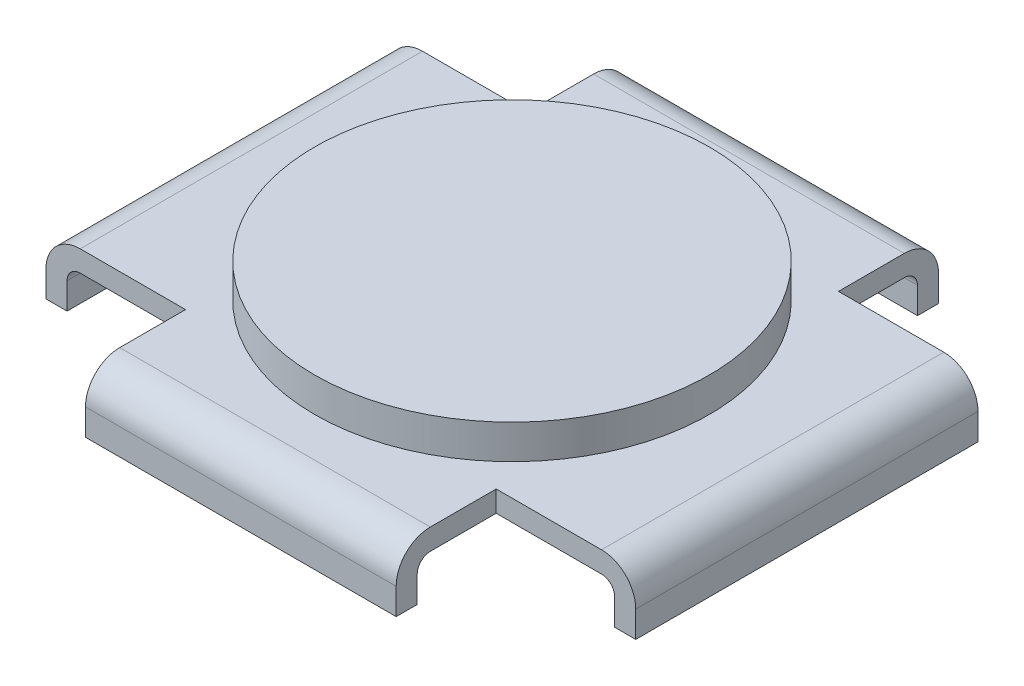
ISO-10303-21;
HEADER;
FILE_DESCRIPTION(('STEP AP214'),'2;1');
FILE_NAME('part.step','',(''),(''),'','','');
FILE_SCHEMA(('AUTOMOTIVE_DESIGN { 1 0 10303 214 1 1 1 1 }'));
ENDSEC;
DATA;
#1=APPLICATION_CONTEXT('core data for automotive mechanical design processes');
#2=APPLICATION_PROTOCOL_DEFINITION('international standard','automotive_design',2000,#1);
#3=PRODUCT_CONTEXT('',#1,'mechanical');
#4=PRODUCT('Part','Part','',(#3));
#5=PRODUCT_RELATED_PRODUCT_CATEGORY('part','',(#4));
#6=PRODUCT_DEFINITION_FORMATION('','',#4);
#7=PRODUCT_DEFINITION_CONTEXT('part definition',#1,'design');
#8=PRODUCT_DEFINITION('design','',#6,#7);
#9=PRODUCT_DEFINITION_SHAPE('','',#8);
#10=(LENGTH_UNIT() NAMED_UNIT(*) SI_UNIT(.MILLI.,.METRE.));
#11=(NAMED_UNIT(*) PLANE_ANGLE_UNIT() SI_UNIT($,.RADIAN.));
#12=(NAMED_UNIT(*) SI_UNIT($,.STERADIAN.) SOLID_ANGLE_UNIT());
#13=UNCERTAINTY_MEASURE_WITH_UNIT(LENGTH_MEASURE(1.E-05),#10,'distance_accuracy_value','');
#14=(GEOMETRIC_REPRESENTATION_CONTEXT(3) GLOBAL_UNCERTAINTY_ASSIGNED_CONTEXT((#13)) GLOBAL_UNIT_ASSIGNED_CONTEXT((#10,
#11,#12)) REPRESENTATION_CONTEXT('',''));
#15=CARTESIAN_POINT('',(0.,0.,0.));
#16=DIRECTION('',(0.,0.,1.));
#17=DIRECTION('',(1.,0.,0.));
#18=AXIS2_PLACEMENT_3D('',#15,#16,#17);
#19=CARTESIAN_POINT('',(0.,0.,0.));
#20=DIRECTION('',(0.,1.,0.));
#21=DIRECTION('',(0.,0.,1.));
#22=AXIS2_PLACEMENT_3D('',#19,#20,#21);
#23=PLANE('',#22);
#24=DIRECTION('',(1.,0.,0.));
#25=VECTOR('',#24,1.);
#26=CARTESIAN_POINT('',(-20.8,0.,-19.));
#27=LINE('',#26,#25);
#28=CARTESIAN_POINT('',(-11.8,0.,-19.));
#29=VERTEX_POINT('',#28);
#30=CARTESIAN_POINT('',(11.8,0.,-19.));
#31=VERTEX_POINT('',#30);
#32=EDGE_CURVE('E386',#29,#31,#27,.T.);
#33=ORIENTED_EDGE('',*,*,#32,.F.);
#34=DIRECTION('',(0.,0.,-1.));
#35=VECTOR('',#34,1.);
#36=CARTESIAN_POINT('',(-11.8,0.,-20.6));
#37=LINE('',#36,#35);
#38=CARTESIAN_POINT('',(-11.8,0.,-20.6));
#39=VERTEX_POINT('',#38);
#40=EDGE_CURVE('E229',#29,#39,#37,.T.);
#41=ORIENTED_EDGE('',*,*,#40,.T.);
#42=DIRECTION('',(-1.,0.,0.));
#43=VECTOR('',#42,1.);
#44=CARTESIAN_POINT('',(-22.4,0.,-20.6));
#45=LINE('',#44,#43);
#46=CARTESIAN_POINT('',(11.8,0.,-20.6));
#47=VERTEX_POINT('',#46);
#48=EDGE_CURVE('E246',#47,#39,#45,.T.);
#49=ORIENTED_EDGE('',*,*,#48,.F.);
#50=DIRECTION('',(0.,0.,1.));
#51=VECTOR('',#50,1.);
#52=CARTESIAN_POINT('',(11.8,0.,-20.6));
#53=LINE('',#52,#51);
#54=EDGE_CURVE('E401',#47,#31,#53,.T.);
#55=ORIENTED_EDGE('',*,*,#54,.T.);
#56=EDGE_LOOP('',(#33,#41,#49,#55));
#57=FACE_BOUND('',#56,.T.);
#58=ADVANCED_FACE('F35',(#57),#23,.F.);
#59=DIRECTION('',(0.,0.,1.));
#60=VECTOR('',#59,1.);
#61=CARTESIAN_POINT('',(-22.4,0.,-20.6));
#62=LINE('',#61,#60);
#63=CARTESIAN_POINT('',(-22.4,0.,-13.));
#64=VERTEX_POINT('',#63);
#65=CARTESIAN_POINT('',(-22.4,0.,13.));
#66=VERTEX_POINT('',#65);
#67=EDGE_CURVE('E235',#64,#66,#62,.T.);
#68=ORIENTED_EDGE('',*,*,#67,.F.);
#69=DIRECTION('',(1.,0.,0.));
#70=VECTOR('',#69,1.);
#71=CARTESIAN_POINT('',(-22.4,0.,-13.));
#72=LINE('',#71,#70);
#73=CARTESIAN_POINT('',(-20.8,0.,-13.));
#74=VERTEX_POINT('',#73);
#75=EDGE_CURVE('E218',#64,#74,#72,.T.);
#76=ORIENTED_EDGE('',*,*,#75,.T.);
#77=DIRECTION('',(0.,0.,-1.));
#78=VECTOR('',#77,1.);
#79=CARTESIAN_POINT('',(-20.8,0.,19.));
#80=LINE('',#79,#78);
#81=CARTESIAN_POINT('',(-20.8,0.,13.));
#82=VERTEX_POINT('',#81);
#83=EDGE_CURVE('E384',#82,#74,#80,.T.);
#84=ORIENTED_EDGE('',*,*,#83,.F.);
#85=DIRECTION('',(-1.,0.,0.));
#86=VECTOR('',#85,1.);
#87=CARTESIAN_POINT('',(-22.4,0.,13.));
#88=LINE('',#87,#86);
#89=EDGE_CURVE('E244',#82,#66,#88,.T.);
#90=ORIENTED_EDGE('',*,*,#89,.T.);
#91=EDGE_LOOP('',(#68,#76,#84,#90));
#92=FACE_BOUND('',#91,.T.);
#93=ADVANCED_FACE('F242',(#92),#23,.F.);
#94=DIRECTION('',(0.,0.,1.));
#95=VECTOR('',#94,1.);
#96=CARTESIAN_POINT('',(20.8,0.,19.));
#97=LINE('',#96,#95);
#98=CARTESIAN_POINT('',(20.8,0.,-13.));
#99=VERTEX_POINT('',#98);
#100=CARTESIAN_POINT('',(20.8,0.,13.));
#101=VERTEX_POINT('',#100);
#102=EDGE_CURVE('E368',#99,#101,#97,.T.);
#103=ORIENTED_EDGE('',*,*,#102,.F.);
#104=DIRECTION('',(1.,0.,0.));
#105=VECTOR('',#104,1.);
#106=CARTESIAN_POINT('',(22.4,0.,-13.));
#107=LINE('',#106,#105);
#108=CARTESIAN_POINT('',(22.4,0.,-13.));
#109=VERTEX_POINT('',#108);
#110=EDGE_CURVE('E399',#99,#109,#107,.T.);
#111=ORIENTED_EDGE('',*,*,#110,.T.);
#112=DIRECTION('',(0.,0.,-1.));
#113=VECTOR('',#112,1.);
#114=CARTESIAN_POINT('',(22.4,0.,-20.6));
#115=LINE('',#114,#113);
#116=CARTESIAN_POINT('',(22.4,0.,13.));
#117=VERTEX_POINT('',#116);
#118=EDGE_CURVE('E251',#117,#109,#115,.T.);
#119=ORIENTED_EDGE('',*,*,#118,.F.);
#120=DIRECTION('',(-1.,0.,0.));
#121=VECTOR('',#120,1.);
#122=CARTESIAN_POINT('',(22.4,0.,13.));
#123=LINE('',#122,#121);
#124=EDGE_CURVE('E398',#117,#101,#123,.T.);
#125=ORIENTED_EDGE('',*,*,#124,.T.);
#126=EDGE_LOOP('',(#103,#111,#119,#125));
#127=FACE_BOUND('',#126,.T.);
#128=ADVANCED_FACE('F397',(#127),#23,.F.);
#129=CARTESIAN_POINT('',(22.4,4.6,-20.6));
#130=DIRECTION('',(-1.,0.,0.));
#131=DIRECTION('',(0.,0.,1.));
#132=AXIS2_PLACEMENT_3D('',#129,#130,#131);
#133=PLANE('',#132);
#134=DIRECTION('',(0.,1.,0.));
#135=VECTOR('',#134,1.);
#136=CARTESIAN_POINT('',(22.4,0.,-13.));
#137=LINE('',#136,#135);
#138=CARTESIAN_POINT('',(22.4,2.,-13.));
#139=VERTEX_POINT('',#138);
#140=EDGE_CURVE('E393',#109,#139,#137,.T.);
#141=ORIENTED_EDGE('',*,*,#140,.T.);
#142=DIRECTION('',(0.,0.,-1.));
#143=VECTOR('',#142,1.);
#144=CARTESIAN_POINT('',(22.4,2.,13.));
#145=LINE('',#144,#143);
#146=CARTESIAN_POINT('',(22.4,2.,13.));
#147=VERTEX_POINT('',#146);
#148=EDGE_CURVE('E304',#139,#147,#145,.F.);
#149=ORIENTED_EDGE('',*,*,#148,.T.);
#150=DIRECTION('',(0.,1.,0.));
#151=VECTOR('',#150,1.);
#152=CARTESIAN_POINT('',(22.4,0.,13.));
#153=LINE('',#152,#151);
#154=EDGE_CURVE('E377',#117,#147,#153,.T.);
#155=ORIENTED_EDGE('',*,*,#154,.F.);
#156=ORIENTED_EDGE('',*,*,#118,.T.);
#157=EDGE_LOOP('',(#141,#149,#155,#156));
#158=FACE_BOUND('',#157,.T.);
#159=ADVANCED_FACE('F392',(#158),#133,.F.);
#160=CARTESIAN_POINT('',(-22.4,4.6,-20.6));
#161=DIRECTION('',(0.,0.,1.));
#162=DIRECTION('',(1.,0.,0.));
#163=AXIS2_PLACEMENT_3D('',#160,#161,#162);
#164=PLANE('',#163);
#165=DIRECTION('',(0.,1.,0.));
#166=VECTOR('',#165,1.);
#167=CARTESIAN_POINT('',(-11.8,0.,-20.6));
#168=LINE('',#167,#166);
#169=CARTESIAN_POINT('',(-11.8,2.,-20.6));
#170=VERTEX_POINT('',#169);
#171=EDGE_CURVE('E455',#39,#170,#168,.T.);
#172=ORIENTED_EDGE('',*,*,#171,.T.);
#173=DIRECTION('',(-1.,0.,0.));
#174=VECTOR('',#173,1.);
#175=CARTESIAN_POINT('',(11.8,2.,-20.6));
#176=LINE('',#175,#174);
#177=CARTESIAN_POINT('',(11.8,2.,-20.6));
#178=VERTEX_POINT('',#177);
#179=EDGE_CURVE('E298',#170,#178,#176,.F.);
#180=ORIENTED_EDGE('',*,*,#179,.T.);
#181=DIRECTION('',(0.,1.,0.));
#182=VECTOR('',#181,1.);
#183=CARTESIAN_POINT('',(11.8,0.,-20.6));
#184=LINE('',#183,#182);
#185=EDGE_CURVE('E400',#47,#178,#184,.T.);
#186=ORIENTED_EDGE('',*,*,#185,.F.);
#187=ORIENTED_EDGE('',*,*,#48,.T.);
#188=EDGE_LOOP('',(#172,#180,#186,#187));
#189=FACE_BOUND('',#188,.T.);
#190=ADVANCED_FACE('F459',(#189),#164,.F.);
#191=CARTESIAN_POINT('',(-22.4,4.6,-20.6));
#192=DIRECTION('',(1.,0.,0.));
#193=DIRECTION('',(0.,0.,-1.));
#194=AXIS2_PLACEMENT_3D('',#191,#192,#193);
#195=PLANE('',#194);
#196=DIRECTION('',(0.,1.,0.));
#197=VECTOR('',#196,1.);
#198=CARTESIAN_POINT('',(-22.4,0.,13.));
#199=LINE('',#198,#197);
#200=CARTESIAN_POINT('',(-22.4,2.,13.));
#201=VERTEX_POINT('',#200);
#202=EDGE_CURVE('E480',#66,#201,#199,.T.);
#203=ORIENTED_EDGE('',*,*,#202,.T.);
#204=DIRECTION('',(0.,0.,1.));
#205=VECTOR('',#204,1.);
#206=CARTESIAN_POINT('',(-22.4,2.,-13.));
#207=LINE('',#206,#205);
#208=CARTESIAN_POINT('',(-22.4,2.,-13.));
#209=VERTEX_POINT('',#208);
#210=EDGE_CURVE('E238',#201,#209,#207,.F.);
#211=ORIENTED_EDGE('',*,*,#210,.T.);
#212=DIRECTION('',(0.,1.,0.));
#213=VECTOR('',#212,1.);
#214=CARTESIAN_POINT('',(-22.4,0.,-13.));
#215=LINE('',#214,#213);
#216=EDGE_CURVE('E221',#64,#209,#215,.T.);
#217=ORIENTED_EDGE('',*,*,#216,.F.);
#218=ORIENTED_EDGE('',*,*,#67,.T.);
#219=EDGE_LOOP('',(#203,#211,#217,#218));
#220=FACE_BOUND('',#219,.T.);
#221=ADVANCED_FACE('F234',(#220),#195,.F.);
#222=CARTESIAN_POINT('',(-22.4,4.6,20.6));
#223=DIRECTION('',(0.,0.,-1.));
#224=DIRECTION('',(-1.,0.,0.));
#225=AXIS2_PLACEMENT_3D('',#222,#223,#224);
#226=PLANE('',#225);
#227=DIRECTION('',(0.,1.,0.));
#228=VECTOR('',#227,1.);
#229=CARTESIAN_POINT('',(11.8,0.,20.6));
#230=LINE('',#229,#228);
#231=CARTESIAN_POINT('',(11.8,0.,20.6));
#232=VERTEX_POINT('',#231);
#233=CARTESIAN_POINT('',(11.8,2.,20.6));
#234=VERTEX_POINT('',#233);
#235=EDGE_CURVE('E370',#232,#234,#230,.T.);
#236=ORIENTED_EDGE('',*,*,#235,.T.);
#237=DIRECTION('',(1.,0.,0.));
#238=VECTOR('',#237,1.);
#239=CARTESIAN_POINT('',(-11.8,2.,20.6));
#240=LINE('',#239,#238);
#241=CARTESIAN_POINT('',(-11.8,2.,20.6));
#242=VERTEX_POINT('',#241);
#243=EDGE_CURVE('E287',#234,#242,#240,.F.);
#244=ORIENTED_EDGE('',*,*,#243,.T.);
#245=DIRECTION('',(0.,1.,0.));
#246=VECTOR('',#245,1.);
#247=CARTESIAN_POINT('',(-11.8,0.,20.6));
#248=LINE('',#247,#246);
#249=CARTESIAN_POINT('',(-11.8,0.,20.6));
#250=VERTEX_POINT('',#249);
#251=EDGE_CURVE('E476',#250,#242,#248,.T.);
#252=ORIENTED_EDGE('',*,*,#251,.F.);
#253=DIRECTION('',(1.,0.,0.));
#254=VECTOR('',#253,1.);
#255=CARTESIAN_POINT('',(-22.4,0.,20.6));
#256=LINE('',#255,#254);
#257=EDGE_CURVE('E245',#250,#232,#256,.T.);
#258=ORIENTED_EDGE('',*,*,#257,.T.);
#259=EDGE_LOOP('',(#236,#244,#252,#258));
#260=FACE_BOUND('',#259,.T.);
#261=ADVANCED_FACE('F515',(#260),#226,.F.);
#262=CARTESIAN_POINT('',(0.,4.6,0.));
#263=DIRECTION('',(0.,1.,0.));
#264=DIRECTION('',(0.,0.,1.));
#265=AXIS2_PLACEMENT_3D('',#262,#263,#264);
#266=PLANE('',#265);
#267=CARTESIAN_POINT('',(0.,4.6,0.));
#268=DIRECTION('',(0.,1.,0.));
#269=DIRECTION('',(0.,0.,1.));
#270=AXIS2_PLACEMENT_3D('',#267,#268,#269);
#271=CIRCLE('',#270,15.);
#272=CARTESIAN_POINT('',(0.,4.6,15.));
#273=VERTEX_POINT('',#272);
#274=EDGE_CURVE('E504',#273,#273,#271,.T.);
#275=ORIENTED_EDGE('',*,*,#274,.F.);
#276=EDGE_LOOP('',(#275));
#277=FACE_BOUND('',#276,.T.);
#278=DIRECTION('',(0.,0.,-1.));
#279=VECTOR('',#278,1.);
#280=CARTESIAN_POINT('',(-11.8,4.6,20.6));
#281=LINE('',#280,#279);
#282=CARTESIAN_POINT('',(-11.8,4.6,18.));
#283=VERTEX_POINT('',#282);
#284=CARTESIAN_POINT('',(-11.8,4.6,13.));
#285=VERTEX_POINT('',#284);
#286=EDGE_CURVE('E470',#283,#285,#281,.T.);
#287=ORIENTED_EDGE('',*,*,#286,.F.);
#288=DIRECTION('',(1.,0.,0.));
#289=VECTOR('',#288,1.);
#290=CARTESIAN_POINT('',(11.8,4.6,18.));
#291=LINE('',#290,#289);
#292=CARTESIAN_POINT('',(11.8,4.6,18.));
#293=VERTEX_POINT('',#292);
#294=EDGE_CURVE('E282',#283,#293,#291,.T.);
#295=ORIENTED_EDGE('',*,*,#294,.T.);
#296=DIRECTION('',(0.,0.,1.));
#297=VECTOR('',#296,1.);
#298=CARTESIAN_POINT('',(11.8,4.6,20.6));
#299=LINE('',#298,#297);
#300=CARTESIAN_POINT('',(11.8,4.6,13.));
#301=VERTEX_POINT('',#300);
#302=EDGE_CURVE('E424',#301,#293,#299,.T.);
#303=ORIENTED_EDGE('',*,*,#302,.F.);
#304=DIRECTION('',(-1.,0.,0.));
#305=VECTOR('',#304,1.);
#306=CARTESIAN_POINT('',(22.4,4.6,13.));
#307=LINE('',#306,#305);
#308=CARTESIAN_POINT('',(19.8,4.6,13.));
#309=VERTEX_POINT('',#308);
#310=EDGE_CURVE('E421',#309,#301,#307,.T.);
#311=ORIENTED_EDGE('',*,*,#310,.F.);
#312=DIRECTION('',(0.,0.,-1.));
#313=VECTOR('',#312,1.);
#314=CARTESIAN_POINT('',(19.8,4.6,-13.));
#315=LINE('',#314,#313);
#316=CARTESIAN_POINT('',(19.8,4.6,-13.));
#317=VERTEX_POINT('',#316);
#318=EDGE_CURVE('E273',#309,#317,#315,.T.);
#319=ORIENTED_EDGE('',*,*,#318,.T.);
#320=DIRECTION('',(1.,0.,0.));
#321=VECTOR('',#320,1.);
#322=CARTESIAN_POINT('',(22.4,4.6,-13.));
#323=LINE('',#322,#321);
#324=CARTESIAN_POINT('',(11.8,4.6,-13.));
#325=VERTEX_POINT('',#324);
#326=EDGE_CURVE('E407',#325,#317,#323,.T.);
#327=ORIENTED_EDGE('',*,*,#326,.F.);
#328=DIRECTION('',(0.,0.,1.));
#329=VECTOR('',#328,1.);
#330=CARTESIAN_POINT('',(11.8,4.6,-20.6));
#331=LINE('',#330,#329);
#332=CARTESIAN_POINT('',(11.8,4.6,-18.));
#333=VERTEX_POINT('',#332);
#334=EDGE_CURVE('E411',#333,#325,#331,.T.);
#335=ORIENTED_EDGE('',*,*,#334,.F.);
#336=DIRECTION('',(-1.,0.,0.));
#337=VECTOR('',#336,1.);
#338=CARTESIAN_POINT('',(-11.8,4.6,-18.));
#339=LINE('',#338,#337);
#340=CARTESIAN_POINT('',(-11.8,4.6,-18.));
#341=VERTEX_POINT('',#340);
#342=EDGE_CURVE('E276',#333,#341,#339,.T.);
#343=ORIENTED_EDGE('',*,*,#342,.T.);
#344=DIRECTION('',(0.,0.,-1.));
#345=VECTOR('',#344,1.);
#346=CARTESIAN_POINT('',(-11.8,4.6,-20.6));
#347=LINE('',#346,#345);
#348=CARTESIAN_POINT('',(-11.8,4.6,-13.));
#349=VERTEX_POINT('',#348);
#350=EDGE_CURVE('E230',#349,#341,#347,.T.);
#351=ORIENTED_EDGE('',*,*,#350,.F.);
#352=DIRECTION('',(1.,0.,0.));
#353=VECTOR('',#352,1.);
#354=CARTESIAN_POINT('',(-22.4,4.6,-13.));
#355=LINE('',#354,#353);
#356=CARTESIAN_POINT('',(-19.8,4.6,-13.));
#357=VERTEX_POINT('',#356);
#358=EDGE_CURVE('E500',#357,#349,#355,.T.);
#359=ORIENTED_EDGE('',*,*,#358,.F.);
#360=DIRECTION('',(0.,0.,1.));
#361=VECTOR('',#360,1.);
#362=CARTESIAN_POINT('',(-19.8,4.6,13.));
#363=LINE('',#362,#361);
#364=CARTESIAN_POINT('',(-19.8,4.6,13.));
#365=VERTEX_POINT('',#364);
#366=EDGE_CURVE('E279',#357,#365,#363,.T.);
#367=ORIENTED_EDGE('',*,*,#366,.T.);
#368=DIRECTION('',(-1.,0.,0.));
#369=VECTOR('',#368,1.);
#370=CARTESIAN_POINT('',(-22.4,4.6,13.));
#371=LINE('',#370,#369);
#372=EDGE_CURVE('E474',#285,#365,#371,.T.);
#373=ORIENTED_EDGE('',*,*,#372,.F.);
#374=EDGE_LOOP('',(#287,#295,#303,#311,#319,#327,#335,#343,#351,#359,#367,#373));
#375=FACE_BOUND('',#374,.T.);
#376=ADVANCED_FACE('F440',(#277,#375),#266,.T.);
#377=ORIENTED_EDGE('',*,*,#257,.F.);
#378=DIRECTION('',(0.,0.,-1.));
#379=VECTOR('',#378,1.);
#380=CARTESIAN_POINT('',(-11.8,0.,20.6));
#381=LINE('',#380,#379);
#382=CARTESIAN_POINT('',(-11.8,0.,19.));
#383=VERTEX_POINT('',#382);
#384=EDGE_CURVE('E471',#250,#383,#381,.T.);
#385=ORIENTED_EDGE('',*,*,#384,.T.);
#386=DIRECTION('',(-1.,0.,0.));
#387=VECTOR('',#386,1.);
#388=CARTESIAN_POINT('',(-20.8,0.,19.));
#389=LINE('',#388,#387);
#390=CARTESIAN_POINT('',(11.8,0.,19.));
#391=VERTEX_POINT('',#390);
#392=EDGE_CURVE('E381',#391,#383,#389,.T.);
#393=ORIENTED_EDGE('',*,*,#392,.F.);
#394=DIRECTION('',(0.,0.,1.));
#395=VECTOR('',#394,1.);
#396=CARTESIAN_POINT('',(11.8,0.,20.6));
#397=LINE('',#396,#395);
#398=EDGE_CURVE('E423',#391,#232,#397,.T.);
#399=ORIENTED_EDGE('',*,*,#398,.T.);
#400=EDGE_LOOP('',(#377,#385,#393,#399));
#401=FACE_BOUND('',#400,.T.);
#402=ADVANCED_FACE('F514',(#401),#23,.F.);
#403=CARTESIAN_POINT('',(20.8,3.,19.));
#404=DIRECTION('',(1.,0.,0.));
#405=DIRECTION('',(0.,0.,-1.));
#406=AXIS2_PLACEMENT_3D('',#403,#404,#405);
#407=PLANE('',#406);
#408=DIRECTION('',(0.,1.,0.));
#409=VECTOR('',#408,1.);
#410=CARTESIAN_POINT('',(20.8,3.,13.));
#411=LINE('',#410,#409);
#412=CARTESIAN_POINT('',(20.8,2.,13.));
#413=VERTEX_POINT('',#412);
#414=EDGE_CURVE('E362',#101,#413,#411,.T.);
#415=ORIENTED_EDGE('',*,*,#414,.T.);
#416=DIRECTION('',(0.,0.,1.));
#417=VECTOR('',#416,1.);
#418=CARTESIAN_POINT('',(20.8,2.,19.));
#419=LINE('',#418,#417);
#420=CARTESIAN_POINT('',(20.8,2.,-13.));
#421=VERTEX_POINT('',#420);
#422=EDGE_CURVE('E324',#413,#421,#419,.F.);
#423=ORIENTED_EDGE('',*,*,#422,.T.);
#424=DIRECTION('',(0.,-1.,0.));
#425=VECTOR('',#424,1.);
#426=CARTESIAN_POINT('',(20.8,3.,-13.));
#427=LINE('',#426,#425);
#428=EDGE_CURVE('E347',#421,#99,#427,.T.);
#429=ORIENTED_EDGE('',*,*,#428,.T.);
#430=ORIENTED_EDGE('',*,*,#102,.T.);
#431=EDGE_LOOP('',(#415,#423,#429,#430));
#432=FACE_BOUND('',#431,.T.);
#433=ADVANCED_FACE('F366',(#432),#407,.F.);
#434=CARTESIAN_POINT('',(-20.8,3.,-19.));
#435=DIRECTION('',(0.,0.,-1.));
#436=DIRECTION('',(-1.,0.,0.));
#437=AXIS2_PLACEMENT_3D('',#434,#435,#436);
#438=PLANE('',#437);
#439=DIRECTION('',(0.,1.,0.));
#440=VECTOR('',#439,1.);
#441=CARTESIAN_POINT('',(11.8,3.,-19.));
#442=LINE('',#441,#440);
#443=CARTESIAN_POINT('',(11.8,2.,-19.));
#444=VERTEX_POINT('',#443);
#445=EDGE_CURVE('E416',#31,#444,#442,.T.);
#446=ORIENTED_EDGE('',*,*,#445,.T.);
#447=DIRECTION('',(1.,0.,0.));
#448=VECTOR('',#447,1.);
#449=CARTESIAN_POINT('',(-20.8,2.,-19.));
#450=LINE('',#449,#448);
#451=CARTESIAN_POINT('',(-11.8,2.,-19.));
#452=VERTEX_POINT('',#451);
#453=EDGE_CURVE('E322',#444,#452,#450,.F.);
#454=ORIENTED_EDGE('',*,*,#453,.T.);
#455=DIRECTION('',(0.,-1.,0.));
#456=VECTOR('',#455,1.);
#457=CARTESIAN_POINT('',(-11.8,3.,-19.));
#458=LINE('',#457,#456);
#459=EDGE_CURVE('E463',#452,#29,#458,.T.);
#460=ORIENTED_EDGE('',*,*,#459,.T.);
#461=ORIENTED_EDGE('',*,*,#32,.T.);
#462=EDGE_LOOP('',(#446,#454,#460,#461));
#463=FACE_BOUND('',#462,.T.);
#464=ADVANCED_FACE('F590',(#463),#438,.F.);
#465=CARTESIAN_POINT('',(-20.8,3.,19.));
#466=DIRECTION('',(-1.,0.,0.));
#467=DIRECTION('',(0.,0.,1.));
#468=AXIS2_PLACEMENT_3D('',#465,#466,#467);
#469=PLANE('',#468);
#470=DIRECTION('',(0.,1.,0.));
#471=VECTOR('',#470,1.);
#472=CARTESIAN_POINT('',(-20.8,3.,-13.));
#473=LINE('',#472,#471);
#474=CARTESIAN_POINT('',(-20.8,2.,-13.));
#475=VERTEX_POINT('',#474);
#476=EDGE_CURVE('E224',#74,#475,#473,.T.);
#477=ORIENTED_EDGE('',*,*,#476,.T.);
#478=DIRECTION('',(0.,0.,-1.));
#479=VECTOR('',#478,1.);
#480=CARTESIAN_POINT('',(-20.8,2.,19.));
#481=LINE('',#480,#479);
#482=CARTESIAN_POINT('',(-20.8,2.,13.));
#483=VERTEX_POINT('',#482);
#484=EDGE_CURVE('E320',#475,#483,#481,.F.);
#485=ORIENTED_EDGE('',*,*,#484,.T.);
#486=DIRECTION('',(0.,-1.,0.));
#487=VECTOR('',#486,1.);
#488=CARTESIAN_POINT('',(-20.8,3.,13.));
#489=LINE('',#488,#487);
#490=EDGE_CURVE('E413',#483,#82,#489,.T.);
#491=ORIENTED_EDGE('',*,*,#490,.T.);
#492=ORIENTED_EDGE('',*,*,#83,.T.);
#493=EDGE_LOOP('',(#477,#485,#491,#492));
#494=FACE_BOUND('',#493,.T.);
#495=ADVANCED_FACE('F490',(#494),#469,.F.);
#496=CARTESIAN_POINT('',(-20.8,3.,19.));
#497=DIRECTION('',(0.,0.,1.));
#498=DIRECTION('',(1.,0.,0.));
#499=AXIS2_PLACEMENT_3D('',#496,#497,#498);
#500=PLANE('',#499);
#501=DIRECTION('',(0.,1.,0.));
#502=VECTOR('',#501,1.);
#503=CARTESIAN_POINT('',(-11.8,3.,19.));
#504=LINE('',#503,#502);
#505=CARTESIAN_POINT('',(-11.8,2.,19.));
#506=VERTEX_POINT('',#505);
#507=EDGE_CURVE('E482',#383,#506,#504,.T.);
#508=ORIENTED_EDGE('',*,*,#507,.T.);
#509=DIRECTION('',(-1.,0.,0.));
#510=VECTOR('',#509,1.);
#511=CARTESIAN_POINT('',(-20.8,2.,19.));
#512=LINE('',#511,#510);
#513=CARTESIAN_POINT('',(11.8,2.,19.));
#514=VERTEX_POINT('',#513);
#515=EDGE_CURVE('E50',#506,#514,#512,.F.);
#516=ORIENTED_EDGE('',*,*,#515,.T.);
#517=DIRECTION('',(0.,-1.,0.));
#518=VECTOR('',#517,1.);
#519=CARTESIAN_POINT('',(11.8,3.,19.));
#520=LINE('',#519,#518);
#521=EDGE_CURVE('E369',#514,#391,#520,.T.);
#522=ORIENTED_EDGE('',*,*,#521,.T.);
#523=ORIENTED_EDGE('',*,*,#392,.T.);
#524=EDGE_LOOP('',(#508,#516,#522,#523));
#525=FACE_BOUND('',#524,.T.);
#526=ADVANCED_FACE('F582',(#525),#500,.F.);
#527=CARTESIAN_POINT('',(0.,3.,0.));
#528=DIRECTION('',(0.,-1.,0.));
#529=DIRECTION('',(0.,0.,-1.));
#530=AXIS2_PLACEMENT_3D('',#527,#528,#529);
#531=PLANE('',#530);
#532=DIRECTION('',(1.,0.,0.));
#533=VECTOR('',#532,1.);
#534=CARTESIAN_POINT('',(0.,3.,13.));
#535=LINE('',#534,#533);
#536=CARTESIAN_POINT('',(-19.8,3.,13.));
#537=VERTEX_POINT('',#536);
#538=CARTESIAN_POINT('',(-11.8,3.,13.));
#539=VERTEX_POINT('',#538);
#540=EDGE_CURVE('E266',#537,#539,#535,.T.);
#541=ORIENTED_EDGE('',*,*,#540,.F.);
#542=DIRECTION('',(0.,0.,-1.));
#543=VECTOR('',#542,1.);
#544=CARTESIAN_POINT('',(-19.8,3.,0.));
#545=LINE('',#544,#543);
#546=CARTESIAN_POINT('',(-19.8,3.,-13.));
#547=VERTEX_POINT('',#546);
#548=EDGE_CURVE('E317',#537,#547,#545,.T.);
#549=ORIENTED_EDGE('',*,*,#548,.T.);
#550=DIRECTION('',(-1.,0.,0.));
#551=VECTOR('',#550,1.);
#552=CARTESIAN_POINT('',(0.,3.,-13.));
#553=LINE('',#552,#551);
#554=CARTESIAN_POINT('',(-11.8,3.,-13.));
#555=VERTEX_POINT('',#554);
#556=EDGE_CURVE('E268',#555,#547,#553,.T.);
#557=ORIENTED_EDGE('',*,*,#556,.F.);
#558=DIRECTION('',(0.,0.,1.));
#559=VECTOR('',#558,1.);
#560=CARTESIAN_POINT('',(-11.8,3.,0.));
#561=LINE('',#560,#559);
#562=CARTESIAN_POINT('',(-11.8,3.,-18.));
#563=VERTEX_POINT('',#562);
#564=EDGE_CURVE('E271',#563,#555,#561,.T.);
#565=ORIENTED_EDGE('',*,*,#564,.F.);
#566=DIRECTION('',(1.,0.,0.));
#567=VECTOR('',#566,1.);
#568=CARTESIAN_POINT('',(0.,3.,-18.));
#569=LINE('',#568,#567);
#570=CARTESIAN_POINT('',(11.8,3.,-18.));
#571=VERTEX_POINT('',#570);
#572=EDGE_CURVE('E314',#563,#571,#569,.T.);
#573=ORIENTED_EDGE('',*,*,#572,.T.);
#574=DIRECTION('',(0.,0.,-1.));
#575=VECTOR('',#574,1.);
#576=CARTESIAN_POINT('',(11.8,3.,0.));
#577=LINE('',#576,#575);
#578=CARTESIAN_POINT('',(11.8,3.,-13.));
#579=VERTEX_POINT('',#578);
#580=EDGE_CURVE('E259',#579,#571,#577,.T.);
#581=ORIENTED_EDGE('',*,*,#580,.F.);
#582=DIRECTION('',(-1.,0.,0.));
#583=VECTOR('',#582,1.);
#584=CARTESIAN_POINT('',(0.,3.,-13.));
#585=LINE('',#584,#583);
#586=CARTESIAN_POINT('',(19.8,3.,-13.));
#587=VERTEX_POINT('',#586);
#588=EDGE_CURVE('E262',#587,#579,#585,.T.);
#589=ORIENTED_EDGE('',*,*,#588,.F.);
#590=DIRECTION('',(0.,0.,1.));
#591=VECTOR('',#590,1.);
#592=CARTESIAN_POINT('',(19.8,3.,0.));
#593=LINE('',#592,#591);
#594=CARTESIAN_POINT('',(19.8,3.,13.));
#595=VERTEX_POINT('',#594);
#596=EDGE_CURVE('E311',#587,#595,#593,.T.);
#597=ORIENTED_EDGE('',*,*,#596,.T.);
#598=DIRECTION('',(1.,0.,0.));
#599=VECTOR('',#598,1.);
#600=CARTESIAN_POINT('',(0.,3.,13.));
#601=LINE('',#600,#599);
#602=CARTESIAN_POINT('',(11.8,3.,13.));
#603=VERTEX_POINT('',#602);
#604=EDGE_CURVE('E248',#603,#595,#601,.T.);
#605=ORIENTED_EDGE('',*,*,#604,.F.);
#606=DIRECTION('',(0.,0.,-1.));
#607=VECTOR('',#606,1.);
#608=CARTESIAN_POINT('',(11.8,3.,0.));
#609=LINE('',#608,#607);
#610=CARTESIAN_POINT('',(11.8,3.,18.));
#611=VERTEX_POINT('',#610);
#612=EDGE_CURVE('E257',#611,#603,#609,.T.);
#613=ORIENTED_EDGE('',*,*,#612,.F.);
#614=DIRECTION('',(-1.,0.,0.));
#615=VECTOR('',#614,1.);
#616=CARTESIAN_POINT('',(0.,3.,18.));
#617=LINE('',#616,#615);
#618=CARTESIAN_POINT('',(-11.8,3.,18.));
#619=VERTEX_POINT('',#618);
#620=EDGE_CURVE('E308',#611,#619,#617,.T.);
#621=ORIENTED_EDGE('',*,*,#620,.T.);
#622=DIRECTION('',(0.,0.,1.));
#623=VECTOR('',#622,1.);
#624=CARTESIAN_POINT('',(-11.8,3.,0.));
#625=LINE('',#624,#623);
#626=EDGE_CURVE('E264',#539,#619,#625,.T.);
#627=ORIENTED_EDGE('',*,*,#626,.F.);
#628=EDGE_LOOP('',(#541,#549,#557,#565,#573,#581,#589,#597,#605,#613,#621,#627));
#629=FACE_BOUND('',#628,.T.);
#630=ADVANCED_FACE('F354',(#629),#531,.T.);
#631=CARTESIAN_POINT('',(11.8,0.,20.6));
#632=DIRECTION('',(-1.,0.,0.));
#633=DIRECTION('',(0.,0.,1.));
#634=AXIS2_PLACEMENT_3D('',#631,#632,#633);
#635=PLANE('',#634);
#636=ORIENTED_EDGE('',*,*,#302,.T.);
#637=CARTESIAN_POINT('',(11.8,2.,18.));
#638=DIRECTION('',(-1.,0.,0.));
#639=DIRECTION('',(0.,0.,1.));
#640=AXIS2_PLACEMENT_3D('',#637,#638,#639);
#641=CIRCLE('',#640,2.6);
#642=EDGE_CURVE('E285',#293,#234,#641,.F.);
#643=ORIENTED_EDGE('',*,*,#642,.T.);
#644=ORIENTED_EDGE('',*,*,#235,.F.);
#645=ORIENTED_EDGE('',*,*,#398,.F.);
#646=ORIENTED_EDGE('',*,*,#521,.F.);
#647=CARTESIAN_POINT('',(11.8,2.,18.));
#648=DIRECTION('',(-1.,0.,0.));
#649=DIRECTION('',(0.,0.,1.));
#650=AXIS2_PLACEMENT_3D('',#647,#648,#649);
#651=CIRCLE('',#650,1.);
#652=EDGE_CURVE('E11',#514,#611,#651,.T.);
#653=ORIENTED_EDGE('',*,*,#652,.T.);
#654=ORIENTED_EDGE('',*,*,#612,.T.);
#655=DIRECTION('',(0.,1.,0.));
#656=VECTOR('',#655,1.);
#657=CARTESIAN_POINT('',(11.8,0.,13.));
#658=LINE('',#657,#656);
#659=EDGE_CURVE('E374',#603,#301,#658,.T.);
#660=ORIENTED_EDGE('',*,*,#659,.T.);
#661=EDGE_LOOP('',(#636,#643,#644,#645,#646,#653,#654,#660));
#662=FACE_BOUND('',#661,.T.);
#663=ADVANCED_FACE('F570',(#662),#635,.F.);
#664=CARTESIAN_POINT('',(22.4,0.,13.));
#665=DIRECTION('',(0.,0.,-1.));
#666=DIRECTION('',(-1.,0.,0.));
#667=AXIS2_PLACEMENT_3D('',#664,#665,#666);
#668=PLANE('',#667);
#669=ORIENTED_EDGE('',*,*,#154,.T.);
#670=CARTESIAN_POINT('',(19.8,2.,13.));
#671=DIRECTION('',(0.,0.,-1.));
#672=DIRECTION('',(-1.,0.,0.));
#673=AXIS2_PLACEMENT_3D('',#670,#671,#672);
#674=CIRCLE('',#673,2.6);
#675=EDGE_CURVE('E306',#147,#309,#674,.F.);
#676=ORIENTED_EDGE('',*,*,#675,.T.);
#677=ORIENTED_EDGE('',*,*,#310,.T.);
#678=ORIENTED_EDGE('',*,*,#659,.F.);
#679=ORIENTED_EDGE('',*,*,#604,.T.);
#680=CARTESIAN_POINT('',(19.8,2.,13.));
#681=DIRECTION('',(0.,0.,-1.));
#682=DIRECTION('',(-1.,0.,0.));
#683=AXIS2_PLACEMENT_3D('',#680,#681,#682);
#684=CIRCLE('',#683,1.);
#685=EDGE_CURVE('E335',#595,#413,#684,.T.);
#686=ORIENTED_EDGE('',*,*,#685,.T.);
#687=ORIENTED_EDGE('',*,*,#414,.F.);
#688=ORIENTED_EDGE('',*,*,#124,.F.);
#689=EDGE_LOOP('',(#669,#676,#677,#678,#679,#686,#687,#688));
#690=FACE_BOUND('',#689,.T.);
#691=ADVANCED_FACE('F361',(#690),#668,.F.);
#692=CARTESIAN_POINT('',(22.4,0.,-13.));
#693=DIRECTION('',(0.,0.,1.));
#694=DIRECTION('',(1.,0.,0.));
#695=AXIS2_PLACEMENT_3D('',#692,#693,#694);
#696=PLANE('',#695);
#697=ORIENTED_EDGE('',*,*,#326,.T.);
#698=CARTESIAN_POINT('',(19.8,2.,-13.));
#699=DIRECTION('',(0.,0.,1.));
#700=DIRECTION('',(1.,0.,0.));
#701=AXIS2_PLACEMENT_3D('',#698,#699,#700);
#702=CIRCLE('',#701,2.6);
#703=EDGE_CURVE('E302',#317,#139,#702,.F.);
#704=ORIENTED_EDGE('',*,*,#703,.T.);
#705=ORIENTED_EDGE('',*,*,#140,.F.);
#706=ORIENTED_EDGE('',*,*,#110,.F.);
#707=ORIENTED_EDGE('',*,*,#428,.F.);
#708=CARTESIAN_POINT('',(19.8,2.,-13.));
#709=DIRECTION('',(0.,0.,1.));
#710=DIRECTION('',(1.,0.,0.));
#711=AXIS2_PLACEMENT_3D('',#708,#709,#710);
#712=CIRCLE('',#711,1.);
#713=EDGE_CURVE('E337',#421,#587,#712,.T.);
#714=ORIENTED_EDGE('',*,*,#713,.T.);
#715=ORIENTED_EDGE('',*,*,#588,.T.);
#716=DIRECTION('',(0.,1.,0.));
#717=VECTOR('',#716,1.);
#718=CARTESIAN_POINT('',(11.8,0.,-13.));
#719=LINE('',#718,#717);
#720=EDGE_CURVE('E404',#579,#325,#719,.T.);
#721=ORIENTED_EDGE('',*,*,#720,.T.);
#722=EDGE_LOOP('',(#697,#704,#705,#706,#707,#714,#715,#721));
#723=FACE_BOUND('',#722,.T.);
#724=ADVANCED_FACE('F343',(#723),#696,.F.);
#725=CARTESIAN_POINT('',(11.8,0.,-20.6));
#726=DIRECTION('',(-1.,0.,0.));
#727=DIRECTION('',(0.,0.,1.));
#728=AXIS2_PLACEMENT_3D('',#725,#726,#727);
#729=PLANE('',#728);
#730=ORIENTED_EDGE('',*,*,#185,.T.);
#731=CARTESIAN_POINT('',(11.8,2.,-18.));
#732=DIRECTION('',(-1.,0.,0.));
#733=DIRECTION('',(0.,0.,1.));
#734=AXIS2_PLACEMENT_3D('',#731,#732,#733);
#735=CIRCLE('',#734,2.6);
#736=EDGE_CURVE('E300',#178,#333,#735,.F.);
#737=ORIENTED_EDGE('',*,*,#736,.T.);
#738=ORIENTED_EDGE('',*,*,#334,.T.);
#739=ORIENTED_EDGE('',*,*,#720,.F.);
#740=ORIENTED_EDGE('',*,*,#580,.T.);
#741=CARTESIAN_POINT('',(11.8,2.,-18.));
#742=DIRECTION('',(-1.,0.,0.));
#743=DIRECTION('',(0.,0.,1.));
#744=AXIS2_PLACEMENT_3D('',#741,#742,#743);
#745=CIRCLE('',#744,1.);
#746=EDGE_CURVE('E331',#571,#444,#745,.T.);
#747=ORIENTED_EDGE('',*,*,#746,.T.);
#748=ORIENTED_EDGE('',*,*,#445,.F.);
#749=ORIENTED_EDGE('',*,*,#54,.F.);
#750=EDGE_LOOP('',(#730,#737,#738,#739,#740,#747,#748,#749));
#751=FACE_BOUND('',#750,.T.);
#752=ADVANCED_FACE('F443',(#751),#729,.F.);
#753=CARTESIAN_POINT('',(-22.4,0.,13.));
#754=DIRECTION('',(0.,0.,-1.));
#755=DIRECTION('',(-1.,0.,0.));
#756=AXIS2_PLACEMENT_3D('',#753,#754,#755);
#757=PLANE('',#756);
#758=ORIENTED_EDGE('',*,*,#372,.T.);
#759=CARTESIAN_POINT('',(-19.8,2.,13.));
#760=DIRECTION('',(0.,0.,-1.));
#761=DIRECTION('',(-1.,0.,0.));
#762=AXIS2_PLACEMENT_3D('',#759,#760,#761);
#763=CIRCLE('',#762,2.6);
#764=EDGE_CURVE('E291',#365,#201,#763,.F.);
#765=ORIENTED_EDGE('',*,*,#764,.T.);
#766=ORIENTED_EDGE('',*,*,#202,.F.);
#767=ORIENTED_EDGE('',*,*,#89,.F.);
#768=ORIENTED_EDGE('',*,*,#490,.F.);
#769=CARTESIAN_POINT('',(-19.8,2.,13.));
#770=DIRECTION('',(0.,0.,-1.));
#771=DIRECTION('',(-1.,0.,0.));
#772=AXIS2_PLACEMENT_3D('',#769,#770,#771);
#773=CIRCLE('',#772,1.);
#774=EDGE_CURVE('E329',#483,#537,#773,.T.);
#775=ORIENTED_EDGE('',*,*,#774,.T.);
#776=ORIENTED_EDGE('',*,*,#540,.T.);
#777=DIRECTION('',(0.,1.,0.));
#778=VECTOR('',#777,1.);
#779=CARTESIAN_POINT('',(-11.8,0.,13.));
#780=LINE('',#779,#778);
#781=EDGE_CURVE('E483',#539,#285,#780,.T.);
#782=ORIENTED_EDGE('',*,*,#781,.T.);
#783=EDGE_LOOP('',(#758,#765,#766,#767,#768,#775,#776,#782));
#784=FACE_BOUND('',#783,.T.);
#785=ADVANCED_FACE('F494',(#784),#757,.F.);
#786=CARTESIAN_POINT('',(-11.8,0.,20.6));
#787=DIRECTION('',(1.,0.,0.));
#788=DIRECTION('',(0.,0.,-1.));
#789=AXIS2_PLACEMENT_3D('',#786,#787,#788);
#790=PLANE('',#789);
#791=ORIENTED_EDGE('',*,*,#251,.T.);
#792=CARTESIAN_POINT('',(-11.8,2.,18.));
#793=DIRECTION('',(1.,0.,0.));
#794=DIRECTION('',(0.,0.,-1.));
#795=AXIS2_PLACEMENT_3D('',#792,#793,#794);
#796=CIRCLE('',#795,2.6);
#797=EDGE_CURVE('E289',#242,#283,#796,.F.);
#798=ORIENTED_EDGE('',*,*,#797,.T.);
#799=ORIENTED_EDGE('',*,*,#286,.T.);
#800=ORIENTED_EDGE('',*,*,#781,.F.);
#801=ORIENTED_EDGE('',*,*,#626,.T.);
#802=CARTESIAN_POINT('',(-11.8,2.,18.));
#803=DIRECTION('',(1.,0.,0.));
#804=DIRECTION('',(0.,0.,-1.));
#805=AXIS2_PLACEMENT_3D('',#802,#803,#804);
#806=CIRCLE('',#805,1.);
#807=EDGE_CURVE('E43',#619,#506,#806,.T.);
#808=ORIENTED_EDGE('',*,*,#807,.T.);
#809=ORIENTED_EDGE('',*,*,#507,.F.);
#810=ORIENTED_EDGE('',*,*,#384,.F.);
#811=EDGE_LOOP('',(#791,#798,#799,#800,#801,#808,#809,#810));
#812=FACE_BOUND('',#811,.T.);
#813=ADVANCED_FACE('F574',(#812),#790,.F.);
#814=CARTESIAN_POINT('',(-11.8,0.,-20.6));
#815=DIRECTION('',(1.,0.,0.));
#816=DIRECTION('',(0.,0.,-1.));
#817=AXIS2_PLACEMENT_3D('',#814,#815,#816);
#818=PLANE('',#817);
#819=ORIENTED_EDGE('',*,*,#350,.T.);
#820=CARTESIAN_POINT('',(-11.8,2.,-18.));
#821=DIRECTION('',(1.,0.,0.));
#822=DIRECTION('',(0.,0.,-1.));
#823=AXIS2_PLACEMENT_3D('',#820,#821,#822);
#824=CIRCLE('',#823,2.6);
#825=EDGE_CURVE('E296',#341,#170,#824,.F.);
#826=ORIENTED_EDGE('',*,*,#825,.T.);
#827=ORIENTED_EDGE('',*,*,#171,.F.);
#828=ORIENTED_EDGE('',*,*,#40,.F.);
#829=ORIENTED_EDGE('',*,*,#459,.F.);
#830=CARTESIAN_POINT('',(-11.8,2.,-18.));
#831=DIRECTION('',(1.,0.,0.));
#832=DIRECTION('',(0.,0.,-1.));
#833=AXIS2_PLACEMENT_3D('',#830,#831,#832);
#834=CIRCLE('',#833,1.);
#835=EDGE_CURVE('E333',#452,#563,#834,.T.);
#836=ORIENTED_EDGE('',*,*,#835,.T.);
#837=ORIENTED_EDGE('',*,*,#564,.T.);
#838=DIRECTION('',(0.,1.,0.));
#839=VECTOR('',#838,1.);
#840=CARTESIAN_POINT('',(-11.8,0.,-13.));
#841=LINE('',#840,#839);
#842=EDGE_CURVE('E239',#555,#349,#841,.T.);
#843=ORIENTED_EDGE('',*,*,#842,.T.);
#844=EDGE_LOOP('',(#819,#826,#827,#828,#829,#836,#837,#843));
#845=FACE_BOUND('',#844,.T.);
#846=ADVANCED_FACE('F453',(#845),#818,.F.);
#847=CARTESIAN_POINT('',(-22.4,0.,-13.));
#848=DIRECTION('',(0.,0.,1.));
#849=DIRECTION('',(1.,0.,0.));
#850=AXIS2_PLACEMENT_3D('',#847,#848,#849);
#851=PLANE('',#850);
#852=ORIENTED_EDGE('',*,*,#216,.T.);
#853=CARTESIAN_POINT('',(-19.8,2.,-13.));
#854=DIRECTION('',(0.,0.,1.));
#855=DIRECTION('',(1.,0.,0.));
#856=AXIS2_PLACEMENT_3D('',#853,#854,#855);
#857=CIRCLE('',#856,2.6);
#858=EDGE_CURVE('E294',#209,#357,#857,.F.);
#859=ORIENTED_EDGE('',*,*,#858,.T.);
#860=ORIENTED_EDGE('',*,*,#358,.T.);
#861=ORIENTED_EDGE('',*,*,#842,.F.);
#862=ORIENTED_EDGE('',*,*,#556,.T.);
#863=CARTESIAN_POINT('',(-19.8,2.,-13.));
#864=DIRECTION('',(0.,0.,1.));
#865=DIRECTION('',(1.,0.,0.));
#866=AXIS2_PLACEMENT_3D('',#863,#864,#865);
#867=CIRCLE('',#866,1.);
#868=EDGE_CURVE('E327',#547,#475,#867,.T.);
#869=ORIENTED_EDGE('',*,*,#868,.T.);
#870=ORIENTED_EDGE('',*,*,#476,.F.);
#871=ORIENTED_EDGE('',*,*,#75,.F.);
#872=EDGE_LOOP('',(#852,#859,#860,#861,#862,#869,#870,#871));
#873=FACE_BOUND('',#872,.T.);
#874=ADVANCED_FACE('F220',(#873),#851,.F.);
#875=CARTESIAN_POINT('',(0.,2.,18.));
#876=DIRECTION('',(-1.,0.,0.));
#877=DIRECTION('',(0.,0.,1.));
#878=AXIS2_PLACEMENT_3D('',#875,#876,#877);
#879=CYLINDRICAL_SURFACE('',#878,2.6);
#880=ORIENTED_EDGE('',*,*,#797,.F.);
#881=ORIENTED_EDGE('',*,*,#243,.F.);
#882=ORIENTED_EDGE('',*,*,#642,.F.);
#883=ORIENTED_EDGE('',*,*,#294,.F.);
#884=EDGE_LOOP('',(#880,#881,#882,#883));
#885=FACE_BOUND('',#884,.T.);
#886=ADVANCED_FACE('F539',(#885),#879,.T.);
#887=CARTESIAN_POINT('',(-19.8,2.,0.));
#888=DIRECTION('',(0.,0.,-1.));
#889=DIRECTION('',(-1.,0.,0.));
#890=AXIS2_PLACEMENT_3D('',#887,#888,#889);
#891=CYLINDRICAL_SURFACE('',#890,2.6);
#892=ORIENTED_EDGE('',*,*,#858,.F.);
#893=ORIENTED_EDGE('',*,*,#210,.F.);
#894=ORIENTED_EDGE('',*,*,#764,.F.);
#895=ORIENTED_EDGE('',*,*,#366,.F.);
#896=EDGE_LOOP('',(#892,#893,#894,#895));
#897=FACE_BOUND('',#896,.T.);
#898=ADVANCED_FACE('F496',(#897),#891,.T.);
#899=CARTESIAN_POINT('',(0.,2.,-18.));
#900=DIRECTION('',(1.,0.,0.));
#901=DIRECTION('',(0.,0.,-1.));
#902=AXIS2_PLACEMENT_3D('',#899,#900,#901);
#903=CYLINDRICAL_SURFACE('',#902,2.6);
#904=ORIENTED_EDGE('',*,*,#736,.F.);
#905=ORIENTED_EDGE('',*,*,#179,.F.);
#906=ORIENTED_EDGE('',*,*,#825,.F.);
#907=ORIENTED_EDGE('',*,*,#342,.F.);
#908=EDGE_LOOP('',(#904,#905,#906,#907));
#909=FACE_BOUND('',#908,.T.);
#910=ADVANCED_FACE('F449',(#909),#903,.T.);
#911=CARTESIAN_POINT('',(19.8,2.,0.));
#912=DIRECTION('',(0.,0.,1.));
#913=DIRECTION('',(1.,0.,0.));
#914=AXIS2_PLACEMENT_3D('',#911,#912,#913);
#915=CYLINDRICAL_SURFACE('',#914,2.6);
#916=ORIENTED_EDGE('',*,*,#675,.F.);
#917=ORIENTED_EDGE('',*,*,#148,.F.);
#918=ORIENTED_EDGE('',*,*,#703,.F.);
#919=ORIENTED_EDGE('',*,*,#318,.F.);
#920=EDGE_LOOP('',(#916,#917,#918,#919));
#921=FACE_BOUND('',#920,.T.);
#922=ADVANCED_FACE('F436',(#921),#915,.T.);
#923=CARTESIAN_POINT('',(-19.8,2.,0.));
#924=DIRECTION('',(0.,0.,-1.));
#925=DIRECTION('',(-1.,0.,0.));
#926=AXIS2_PLACEMENT_3D('',#923,#924,#925);
#927=CYLINDRICAL_SURFACE('',#926,1.);
#928=ORIENTED_EDGE('',*,*,#774,.F.);
#929=ORIENTED_EDGE('',*,*,#484,.F.);
#930=ORIENTED_EDGE('',*,*,#868,.F.);
#931=ORIENTED_EDGE('',*,*,#548,.F.);
#932=EDGE_LOOP('',(#928,#929,#930,#931));
#933=FACE_BOUND('',#932,.T.);
#934=ADVANCED_FACE('F549',(#933),#927,.F.);
#935=CARTESIAN_POINT('',(0.,2.,-18.));
#936=DIRECTION('',(1.,0.,0.));
#937=DIRECTION('',(0.,0.,-1.));
#938=AXIS2_PLACEMENT_3D('',#935,#936,#937);
#939=CYLINDRICAL_SURFACE('',#938,1.);
#940=ORIENTED_EDGE('',*,*,#835,.F.);
#941=ORIENTED_EDGE('',*,*,#453,.F.);
#942=ORIENTED_EDGE('',*,*,#746,.F.);
#943=ORIENTED_EDGE('',*,*,#572,.F.);
#944=EDGE_LOOP('',(#940,#941,#942,#943));
#945=FACE_BOUND('',#944,.T.);
#946=ADVANCED_FACE('F552',(#945),#939,.F.);
#947=CARTESIAN_POINT('',(19.8,2.,0.));
#948=DIRECTION('',(0.,0.,1.));
#949=DIRECTION('',(1.,0.,0.));
#950=AXIS2_PLACEMENT_3D('',#947,#948,#949);
#951=CYLINDRICAL_SURFACE('',#950,1.);
#952=ORIENTED_EDGE('',*,*,#713,.F.);
#953=ORIENTED_EDGE('',*,*,#422,.F.);
#954=ORIENTED_EDGE('',*,*,#685,.F.);
#955=ORIENTED_EDGE('',*,*,#596,.F.);
#956=EDGE_LOOP('',(#952,#953,#954,#955));
#957=FACE_BOUND('',#956,.T.);
#958=ADVANCED_FACE('F356',(#957),#951,.F.);
#959=CARTESIAN_POINT('',(0.,2.,18.));
#960=DIRECTION('',(-1.,0.,0.));
#961=DIRECTION('',(0.,0.,1.));
#962=AXIS2_PLACEMENT_3D('',#959,#960,#961);
#963=CYLINDRICAL_SURFACE('',#962,1.);
#964=ORIENTED_EDGE('',*,*,#652,.F.);
#965=ORIENTED_EDGE('',*,*,#515,.F.);
#966=ORIENTED_EDGE('',*,*,#807,.F.);
#967=ORIENTED_EDGE('',*,*,#620,.F.);
#968=EDGE_LOOP('',(#964,#965,#966,#967));
#969=FACE_BOUND('',#968,.T.);
#970=ADVANCED_FACE('F37',(#969),#963,.F.);
#971=CARTESIAN_POINT('',(0.,7.2,0.));
#972=DIRECTION('',(0.,-1.,0.));
#973=DIRECTION('',(0.,0.,-1.));
#974=AXIS2_PLACEMENT_3D('',#971,#972,#973);
#975=CYLINDRICAL_SURFACE('',#974,15.);
#976=CARTESIAN_POINT('',(0.,7.2,0.));
#977=DIRECTION('',(0.,1.,0.));
#978=DIRECTION('',(0.,0.,1.));
#979=AXIS2_PLACEMENT_3D('',#976,#977,#978);
#980=CIRCLE('',#979,15.);
#981=CARTESIAN_POINT('',(0.,7.2,15.));
#982=VERTEX_POINT('',#981);
#983=EDGE_CURVE('E502',#982,#982,#980,.T.);
#984=ORIENTED_EDGE('',*,*,#983,.F.);
#985=EDGE_LOOP('',(#984));
#986=FACE_BOUND('',#985,.T.);
#987=ORIENTED_EDGE('',*,*,#274,.T.);
#988=EDGE_LOOP('',(#987));
#989=FACE_BOUND('',#988,.T.);
#990=ADVANCED_FACE('F511',(#986,#989),#975,.T.);
#991=CARTESIAN_POINT('',(0.,7.2,0.));
#992=DIRECTION('',(0.,1.,0.));
#993=DIRECTION('',(0.,0.,1.));
#994=AXIS2_PLACEMENT_3D('',#991,#992,#993);
#995=PLANE('',#994);
#996=ORIENTED_EDGE('',*,*,#983,.T.);
#997=EDGE_LOOP('',(#996));
#998=FACE_BOUND('',#997,.T.);
#999=ADVANCED_FACE('F564',(#998),#995,.T.);
#1000=CLOSED_SHELL('',(#58,#93,#128,#159,#190,#221,#261,#376,#402,#433,#464,#495,#526,#630,#663,
#691,#724,#752,#785,#813,#846,#874,#886,#898,#910,#922,#934,#946,#958,#970,#990,#999));
#1001=MANIFOLD_SOLID_BREP('B2',#1000);
#1002=ADVANCED_BREP_SHAPE_REPRESENTATION('',(#18,#1001),#14);
#1003=SHAPE_DEFINITION_REPRESENTATION(#9,#1002);
ENDSEC;
END-ISO-10303-21;
